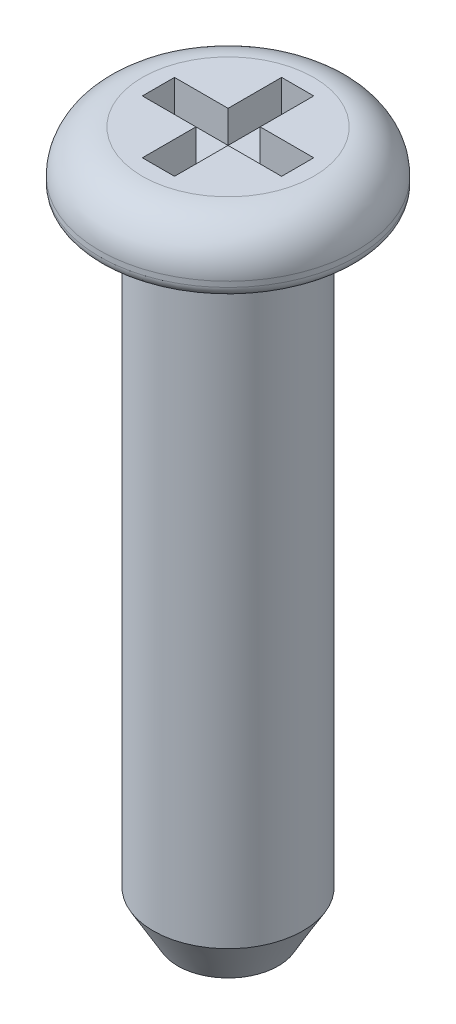
ISO-10303-21;
HEADER;
FILE_DESCRIPTION(('STEP AP214'),'2;1');
FILE_NAME('part.step','',(''),(''),'','','');
FILE_SCHEMA(('AUTOMOTIVE_DESIGN { 1 0 10303 214 1 1 1 1 }'));
ENDSEC;
DATA;
#1=APPLICATION_CONTEXT('core data for automotive mechanical design processes');
#2=APPLICATION_PROTOCOL_DEFINITION('international standard','automotive_design',2000,#1);
#3=PRODUCT_CONTEXT('',#1,'mechanical');
#4=PRODUCT('Part','Part','',(#3));
#5=PRODUCT_RELATED_PRODUCT_CATEGORY('part','',(#4));
#6=PRODUCT_DEFINITION_FORMATION('','',#4);
#7=PRODUCT_DEFINITION_CONTEXT('part definition',#1,'design');
#8=PRODUCT_DEFINITION('design','',#6,#7);
#9=PRODUCT_DEFINITION_SHAPE('','',#8);
#10=(LENGTH_UNIT() NAMED_UNIT(*) SI_UNIT(.MILLI.,.METRE.));
#11=(NAMED_UNIT(*) PLANE_ANGLE_UNIT() SI_UNIT($,.RADIAN.));
#12=(NAMED_UNIT(*) SI_UNIT($,.STERADIAN.) SOLID_ANGLE_UNIT());
#13=UNCERTAINTY_MEASURE_WITH_UNIT(LENGTH_MEASURE(1.E-05),#10,'distance_accuracy_value','');
#14=(GEOMETRIC_REPRESENTATION_CONTEXT(3) GLOBAL_UNCERTAINTY_ASSIGNED_CONTEXT((#13)) GLOBAL_UNIT_ASSIGNED_CONTEXT((#10,
#11,#12)) REPRESENTATION_CONTEXT('',''));
#15=CARTESIAN_POINT('',(0.,0.,0.));
#16=DIRECTION('',(0.,0.,1.));
#17=DIRECTION('',(1.,0.,0.));
#18=AXIS2_PLACEMENT_3D('',#15,#16,#17);
#19=CARTESIAN_POINT('',(0.,0.25,0.));
#20=DIRECTION('',(0.,1.,0.));
#21=DIRECTION('',(0.,0.,1.));
#22=AXIS2_PLACEMENT_3D('',#19,#20,#21);
#23=PLANE('',#22);
#24=DIRECTION('',(0.,0.,1.));
#25=VECTOR('',#24,1.);
#26=CARTESIAN_POINT('',(-0.65,0.25,-0.15));
#27=LINE('',#26,#25);
#28=CARTESIAN_POINT('',(-0.65,0.25,-0.15));
#29=VERTEX_POINT('',#28);
#30=CARTESIAN_POINT('',(-0.65,0.25,0.15));
#31=VERTEX_POINT('',#30);
#32=EDGE_CURVE('E121',#29,#31,#27,.T.);
#33=ORIENTED_EDGE('',*,*,#32,.T.);
#34=DIRECTION('',(1.,0.,0.));
#35=VECTOR('',#34,1.);
#36=CARTESIAN_POINT('',(-0.65,0.25,0.15));
#37=LINE('',#36,#35);
#38=CARTESIAN_POINT('',(-0.15,0.25,0.15));
#39=VERTEX_POINT('',#38);
#40=EDGE_CURVE('E213',#31,#39,#37,.T.);
#41=ORIENTED_EDGE('',*,*,#40,.T.);
#42=DIRECTION('',(0.,0.,1.));
#43=VECTOR('',#42,1.);
#44=CARTESIAN_POINT('',(-0.15,0.25,0.15));
#45=LINE('',#44,#43);
#46=CARTESIAN_POINT('',(-0.15,0.25,0.65));
#47=VERTEX_POINT('',#46);
#48=EDGE_CURVE('E218',#39,#47,#45,.T.);
#49=ORIENTED_EDGE('',*,*,#48,.T.);
#50=DIRECTION('',(1.,0.,0.));
#51=VECTOR('',#50,1.);
#52=CARTESIAN_POINT('',(-0.15,0.25,0.65));
#53=LINE('',#52,#51);
#54=CARTESIAN_POINT('',(0.15,0.25,0.65));
#55=VERTEX_POINT('',#54);
#56=EDGE_CURVE('E222',#47,#55,#53,.T.);
#57=ORIENTED_EDGE('',*,*,#56,.T.);
#58=DIRECTION('',(0.,0.,-1.));
#59=VECTOR('',#58,1.);
#60=CARTESIAN_POINT('',(0.15,0.25,0.65));
#61=LINE('',#60,#59);
#62=CARTESIAN_POINT('',(0.15,0.25,0.15));
#63=VERTEX_POINT('',#62);
#64=EDGE_CURVE('E226',#55,#63,#61,.T.);
#65=ORIENTED_EDGE('',*,*,#64,.T.);
#66=DIRECTION('',(1.,0.,0.));
#67=VECTOR('',#66,1.);
#68=CARTESIAN_POINT('',(0.15,0.25,0.15));
#69=LINE('',#68,#67);
#70=CARTESIAN_POINT('',(0.65,0.25,0.15));
#71=VERTEX_POINT('',#70);
#72=EDGE_CURVE('E230',#63,#71,#69,.T.);
#73=ORIENTED_EDGE('',*,*,#72,.T.);
#74=DIRECTION('',(0.,0.,-1.));
#75=VECTOR('',#74,1.);
#76=CARTESIAN_POINT('',(0.65,0.25,0.15));
#77=LINE('',#76,#75);
#78=CARTESIAN_POINT('',(0.65,0.25,-0.15));
#79=VERTEX_POINT('',#78);
#80=EDGE_CURVE('E234',#71,#79,#77,.T.);
#81=ORIENTED_EDGE('',*,*,#80,.T.);
#82=DIRECTION('',(-1.,0.,0.));
#83=VECTOR('',#82,1.);
#84=CARTESIAN_POINT('',(0.65,0.25,-0.15));
#85=LINE('',#84,#83);
#86=CARTESIAN_POINT('',(0.15,0.25,-0.15));
#87=VERTEX_POINT('',#86);
#88=EDGE_CURVE('E238',#79,#87,#85,.T.);
#89=ORIENTED_EDGE('',*,*,#88,.T.);
#90=DIRECTION('',(0.,0.,-1.));
#91=VECTOR('',#90,1.);
#92=CARTESIAN_POINT('',(0.15,0.25,-0.15));
#93=LINE('',#92,#91);
#94=CARTESIAN_POINT('',(0.15,0.25,-0.65));
#95=VERTEX_POINT('',#94);
#96=EDGE_CURVE('E242',#87,#95,#93,.T.);
#97=ORIENTED_EDGE('',*,*,#96,.T.);
#98=DIRECTION('',(-1.,0.,0.));
#99=VECTOR('',#98,1.);
#100=CARTESIAN_POINT('',(0.15,0.25,-0.65));
#101=LINE('',#100,#99);
#102=CARTESIAN_POINT('',(-0.15,0.25,-0.65));
#103=VERTEX_POINT('',#102);
#104=EDGE_CURVE('E246',#95,#103,#101,.T.);
#105=ORIENTED_EDGE('',*,*,#104,.T.);
#106=DIRECTION('',(0.,0.,1.));
#107=VECTOR('',#106,1.);
#108=CARTESIAN_POINT('',(-0.15,0.25,-0.65));
#109=LINE('',#108,#107);
#110=CARTESIAN_POINT('',(-0.15,0.25,-0.15));
#111=VERTEX_POINT('',#110);
#112=EDGE_CURVE('E117',#103,#111,#109,.T.);
#113=ORIENTED_EDGE('',*,*,#112,.T.);
#114=DIRECTION('',(-1.,0.,0.));
#115=VECTOR('',#114,1.);
#116=CARTESIAN_POINT('',(-0.15,0.25,-0.15));
#117=LINE('',#116,#115);
#118=EDGE_CURVE('E119',#111,#29,#117,.T.);
#119=ORIENTED_EDGE('',*,*,#118,.T.);
#120=EDGE_LOOP('',(#33,#41,#49,#57,#65,#73,#81,#89,#97,#105,#113,#119));
#121=FACE_BOUND('',#120,.T.);
#122=ADVANCED_FACE('F17',(#121),#23,.T.);
#123=CARTESIAN_POINT('',(-0.65,0.55,-0.15));
#124=DIRECTION('',(-1.,0.,0.));
#125=DIRECTION('',(0.,0.,1.));
#126=AXIS2_PLACEMENT_3D('',#123,#124,#125);
#127=PLANE('',#126);
#128=ORIENTED_EDGE('',*,*,#32,.F.);
#129=DIRECTION('',(0.,1.,0.));
#130=VECTOR('',#129,1.);
#131=CARTESIAN_POINT('',(-0.65,0.55,-0.15));
#132=LINE('',#131,#130);
#133=CARTESIAN_POINT('',(-0.65,0.55,-0.15));
#134=VERTEX_POINT('',#133);
#135=EDGE_CURVE('E126',#29,#134,#132,.T.);
#136=ORIENTED_EDGE('',*,*,#135,.T.);
#137=DIRECTION('',(0.,0.,1.));
#138=VECTOR('',#137,1.);
#139=CARTESIAN_POINT('',(-0.65,0.55,0.));
#140=LINE('',#139,#138);
#141=CARTESIAN_POINT('',(-0.65,0.55,0.15));
#142=VERTEX_POINT('',#141);
#143=EDGE_CURVE('E212',#142,#134,#140,.F.);
#144=ORIENTED_EDGE('',*,*,#143,.F.);
#145=DIRECTION('',(0.,1.,0.));
#146=VECTOR('',#145,1.);
#147=CARTESIAN_POINT('',(-0.65,0.55,0.15));
#148=LINE('',#147,#146);
#149=EDGE_CURVE('E132',#142,#31,#148,.F.);
#150=ORIENTED_EDGE('',*,*,#149,.T.);
#151=EDGE_LOOP('',(#128,#136,#144,#150));
#152=FACE_BOUND('',#151,.T.);
#153=ADVANCED_FACE('F129',(#152),#127,.F.);
#154=CARTESIAN_POINT('',(-0.15,0.55,-0.15));
#155=DIRECTION('',(0.,0.,-1.));
#156=DIRECTION('',(-1.,0.,0.));
#157=AXIS2_PLACEMENT_3D('',#154,#155,#156);
#158=PLANE('',#157);
#159=ORIENTED_EDGE('',*,*,#118,.F.);
#160=DIRECTION('',(0.,1.,0.));
#161=VECTOR('',#160,1.);
#162=CARTESIAN_POINT('',(-0.15,0.55,-0.15));
#163=LINE('',#162,#161);
#164=CARTESIAN_POINT('',(-0.15,0.55,-0.15));
#165=VERTEX_POINT('',#164);
#166=EDGE_CURVE('E140',#111,#165,#163,.T.);
#167=ORIENTED_EDGE('',*,*,#166,.T.);
#168=DIRECTION('',(1.,0.,0.));
#169=VECTOR('',#168,1.);
#170=CARTESIAN_POINT('',(0.,0.55,-0.15));
#171=LINE('',#170,#169);
#172=EDGE_CURVE('E137',#134,#165,#171,.T.);
#173=ORIENTED_EDGE('',*,*,#172,.F.);
#174=ORIENTED_EDGE('',*,*,#135,.F.);
#175=EDGE_LOOP('',(#159,#167,#173,#174));
#176=FACE_BOUND('',#175,.T.);
#177=ADVANCED_FACE('F135',(#176),#158,.F.);
#178=CARTESIAN_POINT('',(-0.15,0.55,-0.65));
#179=DIRECTION('',(-1.,0.,0.));
#180=DIRECTION('',(0.,0.,1.));
#181=AXIS2_PLACEMENT_3D('',#178,#179,#180);
#182=PLANE('',#181);
#183=ORIENTED_EDGE('',*,*,#112,.F.);
#184=DIRECTION('',(0.,1.,0.));
#185=VECTOR('',#184,1.);
#186=CARTESIAN_POINT('',(-0.15,0.55,-0.65));
#187=LINE('',#186,#185);
#188=CARTESIAN_POINT('',(-0.15,0.55,-0.65));
#189=VERTEX_POINT('',#188);
#190=EDGE_CURVE('E244',#103,#189,#187,.T.);
#191=ORIENTED_EDGE('',*,*,#190,.T.);
#192=DIRECTION('',(0.,0.,1.));
#193=VECTOR('',#192,1.);
#194=CARTESIAN_POINT('',(-0.15,0.55,0.));
#195=LINE('',#194,#193);
#196=EDGE_CURVE('E250',#165,#189,#195,.F.);
#197=ORIENTED_EDGE('',*,*,#196,.F.);
#198=ORIENTED_EDGE('',*,*,#166,.F.);
#199=EDGE_LOOP('',(#183,#191,#197,#198));
#200=FACE_BOUND('',#199,.T.);
#201=ADVANCED_FACE('F251',(#200),#182,.F.);
#202=CARTESIAN_POINT('',(0.15,0.55,-0.65));
#203=DIRECTION('',(0.,0.,-1.));
#204=DIRECTION('',(-1.,0.,0.));
#205=AXIS2_PLACEMENT_3D('',#202,#203,#204);
#206=PLANE('',#205);
#207=ORIENTED_EDGE('',*,*,#104,.F.);
#208=DIRECTION('',(0.,1.,0.));
#209=VECTOR('',#208,1.);
#210=CARTESIAN_POINT('',(0.15,0.55,-0.65));
#211=LINE('',#210,#209);
#212=CARTESIAN_POINT('',(0.15,0.55,-0.65));
#213=VERTEX_POINT('',#212);
#214=EDGE_CURVE('E240',#95,#213,#211,.T.);
#215=ORIENTED_EDGE('',*,*,#214,.T.);
#216=DIRECTION('',(1.,0.,0.));
#217=VECTOR('',#216,1.);
#218=CARTESIAN_POINT('',(0.,0.55,-0.65));
#219=LINE('',#218,#217);
#220=EDGE_CURVE('E256',#189,#213,#219,.T.);
#221=ORIENTED_EDGE('',*,*,#220,.F.);
#222=ORIENTED_EDGE('',*,*,#190,.F.);
#223=EDGE_LOOP('',(#207,#215,#221,#222));
#224=FACE_BOUND('',#223,.T.);
#225=ADVANCED_FACE('F466',(#224),#206,.F.);
#226=CARTESIAN_POINT('',(0.15,0.55,-0.15));
#227=DIRECTION('',(1.,0.,0.));
#228=DIRECTION('',(0.,0.,-1.));
#229=AXIS2_PLACEMENT_3D('',#226,#227,#228);
#230=PLANE('',#229);
#231=ORIENTED_EDGE('',*,*,#96,.F.);
#232=DIRECTION('',(0.,1.,0.));
#233=VECTOR('',#232,1.);
#234=CARTESIAN_POINT('',(0.15,0.55,-0.15));
#235=LINE('',#234,#233);
#236=CARTESIAN_POINT('',(0.15,0.55,-0.15));
#237=VERTEX_POINT('',#236);
#238=EDGE_CURVE('E236',#87,#237,#235,.T.);
#239=ORIENTED_EDGE('',*,*,#238,.T.);
#240=DIRECTION('',(0.,0.,1.));
#241=VECTOR('',#240,1.);
#242=CARTESIAN_POINT('',(0.15,0.55,0.));
#243=LINE('',#242,#241);
#244=EDGE_CURVE('E264',#213,#237,#243,.T.);
#245=ORIENTED_EDGE('',*,*,#244,.F.);
#246=ORIENTED_EDGE('',*,*,#214,.F.);
#247=EDGE_LOOP('',(#231,#239,#245,#246));
#248=FACE_BOUND('',#247,.T.);
#249=ADVANCED_FACE('F457',(#248),#230,.F.);
#250=CARTESIAN_POINT('',(0.65,0.55,-0.15));
#251=DIRECTION('',(0.,0.,-1.));
#252=DIRECTION('',(-1.,0.,0.));
#253=AXIS2_PLACEMENT_3D('',#250,#251,#252);
#254=PLANE('',#253);
#255=ORIENTED_EDGE('',*,*,#88,.F.);
#256=DIRECTION('',(0.,1.,0.));
#257=VECTOR('',#256,1.);
#258=CARTESIAN_POINT('',(0.65,0.55,-0.15));
#259=LINE('',#258,#257);
#260=CARTESIAN_POINT('',(0.65,0.55,-0.15));
#261=VERTEX_POINT('',#260);
#262=EDGE_CURVE('E232',#79,#261,#259,.T.);
#263=ORIENTED_EDGE('',*,*,#262,.T.);
#264=DIRECTION('',(1.,0.,0.));
#265=VECTOR('',#264,1.);
#266=CARTESIAN_POINT('',(0.,0.55,-0.15));
#267=LINE('',#266,#265);
#268=EDGE_CURVE('E267',#237,#261,#267,.T.);
#269=ORIENTED_EDGE('',*,*,#268,.F.);
#270=ORIENTED_EDGE('',*,*,#238,.F.);
#271=EDGE_LOOP('',(#255,#263,#269,#270));
#272=FACE_BOUND('',#271,.T.);
#273=ADVANCED_FACE('F448',(#272),#254,.F.);
#274=CARTESIAN_POINT('',(0.65,0.55,0.15));
#275=DIRECTION('',(1.,0.,0.));
#276=DIRECTION('',(0.,0.,-1.));
#277=AXIS2_PLACEMENT_3D('',#274,#275,#276);
#278=PLANE('',#277);
#279=ORIENTED_EDGE('',*,*,#80,.F.);
#280=DIRECTION('',(0.,1.,0.));
#281=VECTOR('',#280,1.);
#282=CARTESIAN_POINT('',(0.65,0.55,0.15));
#283=LINE('',#282,#281);
#284=CARTESIAN_POINT('',(0.65,0.55,0.15));
#285=VERTEX_POINT('',#284);
#286=EDGE_CURVE('E228',#71,#285,#283,.T.);
#287=ORIENTED_EDGE('',*,*,#286,.T.);
#288=DIRECTION('',(0.,0.,1.));
#289=VECTOR('',#288,1.);
#290=CARTESIAN_POINT('',(0.65,0.55,0.));
#291=LINE('',#290,#289);
#292=EDGE_CURVE('E270',#261,#285,#291,.T.);
#293=ORIENTED_EDGE('',*,*,#292,.F.);
#294=ORIENTED_EDGE('',*,*,#262,.F.);
#295=EDGE_LOOP('',(#279,#287,#293,#294));
#296=FACE_BOUND('',#295,.T.);
#297=ADVANCED_FACE('F439',(#296),#278,.F.);
#298=CARTESIAN_POINT('',(0.15,0.55,0.15));
#299=DIRECTION('',(0.,0.,1.));
#300=DIRECTION('',(1.,0.,0.));
#301=AXIS2_PLACEMENT_3D('',#298,#299,#300);
#302=PLANE('',#301);
#303=ORIENTED_EDGE('',*,*,#72,.F.);
#304=DIRECTION('',(0.,1.,0.));
#305=VECTOR('',#304,1.);
#306=CARTESIAN_POINT('',(0.15,0.55,0.15));
#307=LINE('',#306,#305);
#308=CARTESIAN_POINT('',(0.15,0.55,0.15));
#309=VERTEX_POINT('',#308);
#310=EDGE_CURVE('E224',#63,#309,#307,.T.);
#311=ORIENTED_EDGE('',*,*,#310,.T.);
#312=DIRECTION('',(1.,0.,0.));
#313=VECTOR('',#312,1.);
#314=CARTESIAN_POINT('',(0.,0.55,0.15));
#315=LINE('',#314,#313);
#316=EDGE_CURVE('E273',#285,#309,#315,.F.);
#317=ORIENTED_EDGE('',*,*,#316,.F.);
#318=ORIENTED_EDGE('',*,*,#286,.F.);
#319=EDGE_LOOP('',(#303,#311,#317,#318));
#320=FACE_BOUND('',#319,.T.);
#321=ADVANCED_FACE('F430',(#320),#302,.F.);
#322=CARTESIAN_POINT('',(0.15,0.55,0.65));
#323=DIRECTION('',(1.,0.,0.));
#324=DIRECTION('',(0.,0.,-1.));
#325=AXIS2_PLACEMENT_3D('',#322,#323,#324);
#326=PLANE('',#325);
#327=ORIENTED_EDGE('',*,*,#64,.F.);
#328=DIRECTION('',(0.,1.,0.));
#329=VECTOR('',#328,1.);
#330=CARTESIAN_POINT('',(0.15,0.55,0.65));
#331=LINE('',#330,#329);
#332=CARTESIAN_POINT('',(0.15,0.55,0.65));
#333=VERTEX_POINT('',#332);
#334=EDGE_CURVE('E220',#55,#333,#331,.T.);
#335=ORIENTED_EDGE('',*,*,#334,.T.);
#336=DIRECTION('',(0.,0.,1.));
#337=VECTOR('',#336,1.);
#338=CARTESIAN_POINT('',(0.15,0.55,0.));
#339=LINE('',#338,#337);
#340=EDGE_CURVE('E276',#309,#333,#339,.T.);
#341=ORIENTED_EDGE('',*,*,#340,.F.);
#342=ORIENTED_EDGE('',*,*,#310,.F.);
#343=EDGE_LOOP('',(#327,#335,#341,#342));
#344=FACE_BOUND('',#343,.T.);
#345=ADVANCED_FACE('F421',(#344),#326,.F.);
#346=CARTESIAN_POINT('',(-0.15,0.55,0.65));
#347=DIRECTION('',(0.,0.,1.));
#348=DIRECTION('',(1.,0.,0.));
#349=AXIS2_PLACEMENT_3D('',#346,#347,#348);
#350=PLANE('',#349);
#351=ORIENTED_EDGE('',*,*,#56,.F.);
#352=DIRECTION('',(0.,1.,0.));
#353=VECTOR('',#352,1.);
#354=CARTESIAN_POINT('',(-0.15,0.55,0.65));
#355=LINE('',#354,#353);
#356=CARTESIAN_POINT('',(-0.15,0.55,0.65));
#357=VERTEX_POINT('',#356);
#358=EDGE_CURVE('E216',#47,#357,#355,.T.);
#359=ORIENTED_EDGE('',*,*,#358,.T.);
#360=DIRECTION('',(1.,0.,0.));
#361=VECTOR('',#360,1.);
#362=CARTESIAN_POINT('',(0.,0.55,0.65));
#363=LINE('',#362,#361);
#364=EDGE_CURVE('E279',#333,#357,#363,.F.);
#365=ORIENTED_EDGE('',*,*,#364,.F.);
#366=ORIENTED_EDGE('',*,*,#334,.F.);
#367=EDGE_LOOP('',(#351,#359,#365,#366));
#368=FACE_BOUND('',#367,.T.);
#369=ADVANCED_FACE('F412',(#368),#350,.F.);
#370=CARTESIAN_POINT('',(-0.15,0.55,0.15));
#371=DIRECTION('',(-1.,0.,0.));
#372=DIRECTION('',(0.,0.,1.));
#373=AXIS2_PLACEMENT_3D('',#370,#371,#372);
#374=PLANE('',#373);
#375=ORIENTED_EDGE('',*,*,#48,.F.);
#376=DIRECTION('',(0.,1.,0.));
#377=VECTOR('',#376,1.);
#378=CARTESIAN_POINT('',(-0.15,0.55,0.15));
#379=LINE('',#378,#377);
#380=CARTESIAN_POINT('',(-0.15,0.55,0.15));
#381=VERTEX_POINT('',#380);
#382=EDGE_CURVE('E205',#39,#381,#379,.T.);
#383=ORIENTED_EDGE('',*,*,#382,.T.);
#384=DIRECTION('',(0.,0.,1.));
#385=VECTOR('',#384,1.);
#386=CARTESIAN_POINT('',(-0.15,0.55,0.));
#387=LINE('',#386,#385);
#388=EDGE_CURVE('E282',#357,#381,#387,.F.);
#389=ORIENTED_EDGE('',*,*,#388,.F.);
#390=ORIENTED_EDGE('',*,*,#358,.F.);
#391=EDGE_LOOP('',(#375,#383,#389,#390));
#392=FACE_BOUND('',#391,.T.);
#393=ADVANCED_FACE('F404',(#392),#374,.F.);
#394=CARTESIAN_POINT('',(-0.65,0.55,0.15));
#395=DIRECTION('',(0.,0.,1.));
#396=DIRECTION('',(1.,0.,0.));
#397=AXIS2_PLACEMENT_3D('',#394,#395,#396);
#398=PLANE('',#397);
#399=ORIENTED_EDGE('',*,*,#40,.F.);
#400=ORIENTED_EDGE('',*,*,#149,.F.);
#401=DIRECTION('',(1.,0.,0.));
#402=VECTOR('',#401,1.);
#403=CARTESIAN_POINT('',(0.,0.55,0.15));
#404=LINE('',#403,#402);
#405=EDGE_CURVE('E284',#381,#142,#404,.F.);
#406=ORIENTED_EDGE('',*,*,#405,.F.);
#407=ORIENTED_EDGE('',*,*,#382,.F.);
#408=EDGE_LOOP('',(#399,#400,#406,#407));
#409=FACE_BOUND('',#408,.T.);
#410=ADVANCED_FACE('F397',(#409),#398,.F.);
#411=CARTESIAN_POINT('',(0.,0.55,0.));
#412=DIRECTION('',(0.,1.,0.));
#413=DIRECTION('',(0.,0.,1.));
#414=AXIS2_PLACEMENT_3D('',#411,#412,#413);
#415=PLANE('',#414);
#416=ORIENTED_EDGE('',*,*,#388,.T.);
#417=ORIENTED_EDGE('',*,*,#405,.T.);
#418=ORIENTED_EDGE('',*,*,#143,.T.);
#419=ORIENTED_EDGE('',*,*,#172,.T.);
#420=ORIENTED_EDGE('',*,*,#196,.T.);
#421=ORIENTED_EDGE('',*,*,#220,.T.);
#422=ORIENTED_EDGE('',*,*,#244,.T.);
#423=ORIENTED_EDGE('',*,*,#268,.T.);
#424=ORIENTED_EDGE('',*,*,#292,.T.);
#425=ORIENTED_EDGE('',*,*,#316,.T.);
#426=ORIENTED_EDGE('',*,*,#340,.T.);
#427=ORIENTED_EDGE('',*,*,#364,.T.);
#428=EDGE_LOOP('',(#416,#417,#418,#419,#420,#421,#422,#423,#424,#425,#426,#427));
#429=FACE_BOUND('',#428,.T.);
#430=CARTESIAN_POINT('',(0.,0.55,0.));
#431=DIRECTION('',(0.,-1.,0.));
#432=DIRECTION('',(0.,0.,1.));
#433=AXIS2_PLACEMENT_3D('',#430,#431,#432);
#434=CIRCLE('',#433,0.79999999550235);
#435=CARTESIAN_POINT('',(0.,0.55,0.79999999280376));
#436=VERTEX_POINT('',#435);
#437=CARTESIAN_POINT('',(0.,0.55,-0.79999999280376));
#438=VERTEX_POINT('',#437);
#439=EDGE_CURVE('E304',#436,#438,#434,.T.);
#440=ORIENTED_EDGE('',*,*,#439,.F.);
#441=CARTESIAN_POINT('',(0.,0.55,0.));
#442=DIRECTION('',(0.,-1.,0.));
#443=DIRECTION('',(0.,0.,-1.));
#444=AXIS2_PLACEMENT_3D('',#441,#442,#443);
#445=CIRCLE('',#444,0.7999999910047);
#446=EDGE_CURVE('E286',#438,#436,#445,.T.);
#447=ORIENTED_EDGE('',*,*,#446,.F.);
#448=EDGE_LOOP('',(#440,#447));
#449=FACE_BOUND('',#448,.T.);
#450=ADVANCED_FACE('F193',(#429,#449),#415,.T.);
#451=CARTESIAN_POINT('',(0.,0.15,0.));
#452=DIRECTION('',(0.,1.,0.));
#453=DIRECTION('',(0.00945357762261842,0.,-0.999955313936644));
#454=AXIS2_PLACEMENT_3D('',#451,#452,#453);
#455=TOROIDAL_SURFACE('',#454,0.8,0.4);
#456=CARTESIAN_POINT('',(0.,0.15,0.));
#457=DIRECTION('',(0.,1.,0.));
#458=DIRECTION('',(0.,0.,1.));
#459=AXIS2_PLACEMENT_3D('',#456,#457,#458);
#460=CIRCLE('',#459,1.2);
#461=CARTESIAN_POINT('',(0.,0.15,1.2));
#462=VERTEX_POINT('',#461);
#463=EDGE_CURVE('E184',#462,#462,#460,.F.);
#464=ORIENTED_EDGE('',*,*,#463,.F.);
#465=EDGE_LOOP('',(#464));
#466=FACE_BOUND('',#465,.T.);
#467=ORIENTED_EDGE('',*,*,#439,.T.);
#468=ORIENTED_EDGE('',*,*,#446,.T.);
#469=EDGE_LOOP('',(#467,#468));
#470=FACE_BOUND('',#469,.T.);
#471=ADVANCED_FACE('F188',(#466,#470),#455,.T.);
#472=CARTESIAN_POINT('',(0.,0.,0.));
#473=DIRECTION('',(0.,1.,0.));
#474=DIRECTION('',(0.,0.,1.));
#475=AXIS2_PLACEMENT_3D('',#472,#473,#474);
#476=CYLINDRICAL_SURFACE('',#475,1.2);
#477=CARTESIAN_POINT('',(0.,0.1,0.));
#478=DIRECTION('',(0.,1.,0.));
#479=DIRECTION('',(0.0134291293986406,0.,0.999909825176048));
#480=AXIS2_PLACEMENT_3D('',#477,#478,#479);
#481=CIRCLE('',#480,1.2);
#482=CARTESIAN_POINT('',(0.0161149552783688,0.1,1.19989179021126));
#483=VERTEX_POINT('',#482);
#484=EDGE_CURVE('E146',#483,#483,#481,.F.);
#485=ORIENTED_EDGE('',*,*,#484,.F.);
#486=EDGE_LOOP('',(#485));
#487=FACE_BOUND('',#486,.T.);
#488=ORIENTED_EDGE('',*,*,#463,.T.);
#489=EDGE_LOOP('',(#488));
#490=FACE_BOUND('',#489,.T.);
#491=ADVANCED_FACE('F192',(#487,#490),#476,.T.);
#492=CARTESIAN_POINT('',(0.,-6.,0.));
#493=DIRECTION('',(0.,-1.,0.));
#494=DIRECTION('',(0.,0.,-1.));
#495=AXIS2_PLACEMENT_3D('',#492,#493,#494);
#496=PLANE('',#495);
#497=CARTESIAN_POINT('',(0.,-5.99999999997181,0.));
#498=DIRECTION('',(0.,1.,0.));
#499=DIRECTION('',(0.,0.,1.));
#500=AXIS2_PLACEMENT_3D('',#497,#498,#499);
#501=CIRCLE('',#500,0.469059892282075);
#502=CARTESIAN_POINT('',(0.,-5.99999999997181,0.469059892282075));
#503=VERTEX_POINT('',#502);
#504=EDGE_CURVE('E144',#503,#503,#501,.T.);
#505=ORIENTED_EDGE('',*,*,#504,.F.);
#506=EDGE_LOOP('',(#505));
#507=FACE_BOUND('',#506,.T.);
#508=ADVANCED_FACE('F163',(#507),#496,.T.);
#509=CARTESIAN_POINT('',(0.,0.1,0.));
#510=DIRECTION('',(0.,1.,0.));
#511=DIRECTION('',(0.0134291293986406,0.,0.999909825176048));
#512=AXIS2_PLACEMENT_3D('',#509,#510,#511);
#513=TOROIDAL_SURFACE('',#512,1.1,0.1);
#514=ORIENTED_EDGE('',*,*,#484,.T.);
#515=EDGE_LOOP('',(#514));
#516=FACE_BOUND('',#515,.T.);
#517=CARTESIAN_POINT('',(0.,0.,0.));
#518=DIRECTION('',(0.,1.,0.));
#519=DIRECTION('',(0.,0.,-1.));
#520=AXIS2_PLACEMENT_3D('',#517,#518,#519);
#521=CIRCLE('',#520,1.0999999820745);
#522=CARTESIAN_POINT('',(0.,0.,-1.0999999749043));
#523=VERTEX_POINT('',#522);
#524=CARTESIAN_POINT('',(0.,0.,1.0999999749043));
#525=VERTEX_POINT('',#524);
#526=EDGE_CURVE('E173',#523,#525,#521,.T.);
#527=ORIENTED_EDGE('',*,*,#526,.T.);
#528=CARTESIAN_POINT('',(0.,0.,1.099999964149));
#529=CARTESIAN_POINT('',(0.00492406061414348,-3.54563877889075E-11,1.10000049536148));
#530=CARTESIAN_POINT('',(0.00984825022011473,-2.07130719296641E-11,1.09996849488545));
#531=CARTESIAN_POINT('',(0.0266316200309335,2.00630534293323E-10,1.09974791268392));
#532=CARTESIAN_POINT('',(0.0384890835170656,6.48227424068439E-10,1.09940226453741));
#533=CARTESIAN_POINT('',(0.0621864091491095,2.12545776433485E-09,1.09832633674333));
#534=CARTESIAN_POINT('',(0.0740262710790623,3.15509829796221E-09,1.09759605241496));
#535=CARTESIAN_POINT('',(0.100209082047479,5.97279352624228E-09,1.09555562836706));
#536=CARTESIAN_POINT('',(0.114545063485567,7.876046159774E-09,1.09415480101715));
#537=CARTESIAN_POINT('',(0.143150944482853,1.22775011359457E-08,1.09079092629783));
#538=CARTESIAN_POINT('',(0.15742084315618,1.47757114308651E-08,1.08882787141354));
#539=CARTESIAN_POINT('',(0.185872733977188,2.02436595798314E-08,1.0843426909109));
#540=CARTESIAN_POINT('',(0.200054725015496,2.32134033719787E-08,1.08182055825184));
#541=CARTESIAN_POINT('',(0.228308833397649,2.95107238903449E-08,1.07622106855444));
#542=CARTESIAN_POINT('',(0.242380949440641,3.2838304846266E-08,1.07314370495287));
#543=CARTESIAN_POINT('',(0.270393584454543,3.97441645805892E-08,1.0664385031888));
#544=CARTESIAN_POINT('',(0.284334101969741,4.33224461285036E-08,1.06281065894455));
#545=CARTESIAN_POINT('',(0.312061999565104,5.06299803370416E-08,1.05501008495274));
#546=CARTESIAN_POINT('',(0.325849378070124,5.43592345486978E-08,1.0508373496062));
#547=CARTESIAN_POINT('',(0.353249698936276,6.18761683401936E-08,1.04195342832046));
#548=CARTESIAN_POINT('',(0.36686263963839,6.56638484749481E-08,1.0372422372644));
#549=CARTESIAN_POINT('',(0.393893054035974,7.32123303041568E-08,1.02728867129659));
#550=CARTESIAN_POINT('',(0.407310526023777,7.69731317636458E-08,1.02204629174741));
#551=CARTESIAN_POINT('',(0.433929274348065,8.438977802763E-08,1.01103843722045));
#552=CARTESIAN_POINT('',(0.447130548963114,8.80456219965926E-08,1.00527295807997));
#553=CARTESIAN_POINT('',(0.473296507716812,9.51815051022812E-08,0.993227801690416));
#554=CARTESIAN_POINT('',(0.486261190154656,9.86615429754971E-08,0.986948120746649));
#555=CARTESIAN_POINT('',(0.511933935250397,1.05382194526751E-07,0.973884253284614));
#556=CARTESIAN_POINT('',(0.524641996261952,1.08622806669121E-07,0.967100063531004));
#557=CARTESIAN_POINT('',(0.549781865693902,1.14808216596856E-07,0.953037651186801));
#558=CARTESIAN_POINT('',(0.562213672555577,1.17753012713458E-07,0.945759425809634));
#559=CARTESIAN_POINT('',(0.586781827770156,1.23297629513838E-07,0.930720178966331));
#560=CARTESIAN_POINT('',(0.598918174684351,1.25897448518065E-07,0.922959155149919));
#561=CARTESIAN_POINT('',(0.622876660708366,1.30710179169617E-07,0.906966294802693));
#562=CARTESIAN_POINT('',(0.634698798531008,1.32923089232154E-07,0.898734456343593));
#563=CARTESIAN_POINT('',(0.658010602722806,1.36927299234906E-07,0.88181267817315));
#564=CARTESIAN_POINT('',(0.669500267986875,1.38718597773891E-07,0.873122736939416));
#565=CARTESIAN_POINT('',(0.692129377330427,1.41852111102811E-07,0.855298173101806));
#566=CARTESIAN_POINT('',(0.703268820516421,1.43194324747121E-07,0.846163549363604));
#567=CARTESIAN_POINT('',(0.725180277366503,1.45409423863692E-07,0.827463728053893));
#568=CARTESIAN_POINT('',(0.735952290377065,1.46282308501228E-07,0.817898529716617));
#569=CARTESIAN_POINT('',(0.757112246569873,1.4754573438082E-07,0.798352332569582));
#570=CARTESIAN_POINT('',(0.767500189365698,1.47936275137591E-07,0.788371333341498));
#571=CARTESIAN_POINT('',(0.787875958610776,1.48229227229716E-07,0.768008950735279));
#572=CARTESIAN_POINT('',(0.797863784966542,1.48131638451018E-07,0.757627567263595));
#573=CARTESIAN_POINT('',(0.817423893438803,1.47449774675404E-07,0.73648045159563));
#574=CARTESIAN_POINT('',(0.826996175779188,1.46865499940712E-07,0.725714719606437));
#575=CARTESIAN_POINT('',(0.845710410832574,1.45218936715657E-07,0.703815536614136));
#576=CARTESIAN_POINT('',(0.854852364109825,1.44156648852087E-07,0.692682086093216));
#577=CARTESIAN_POINT('',(0.872691821037045,1.41569961066279E-07,0.670064664294874));
#578=CARTESIAN_POINT('',(0.88138932561307,1.40045562106944E-07,0.658580693747878));
#579=CARTESIAN_POINT('',(0.898326452378921,1.36557783149615E-07,0.63527997208221));
#580=CARTESIAN_POINT('',(0.906566075876453,1.34594404405425E-07,0.623463221914102));
#581=CARTESIAN_POINT('',(0.922574715755324,1.30259026155237E-07,0.599515195659645));
#582=CARTESIAN_POINT('',(0.930343733844201,1.27887028131986E-07,0.587383920714742));
#583=CARTESIAN_POINT('',(0.945399165895756,1.2277200094422E-07,0.562825585772909));
#584=CARTESIAN_POINT('',(0.952685581982258,1.20028973412685E-07,0.550398527077986));
#585=CARTESIAN_POINT('',(0.966764559302153,1.14216706154493E-07,0.525267822706477));
#586=CARTESIAN_POINT('',(0.973557123090332,1.11147468115584E-07,0.51256417846116));
#587=CARTESIAN_POINT('',(0.986637908778086,1.04734828146223E-07,0.48689992854548));
#588=CARTESIAN_POINT('',(0.992926133676256,1.01391427846069E-07,0.473939324403469));
#589=CARTESIAN_POINT('',(1.00498853445922,9.44897410335962E-08,0.447781177361619));
#590=CARTESIAN_POINT('',(1.01076271379739,9.09314559651501E-08,0.434583636054248));
#591=CARTESIAN_POINT('',(1.02178811127848,8.36665066936245E-08,0.407972003452976));
#592=CARTESIAN_POINT('',(1.0270393333386,7.9959843602261E-08,0.394557913782003));
#593=CARTESIAN_POINT('',(1.03701071274552,7.24718747804463E-08,0.367533907815091));
#594=CARTESIAN_POINT('',(1.04173087448046,6.86905696670644E-08,0.353923993138299));
#595=CARTESIAN_POINT('',(1.0506328511473,6.11342826864161E-08,0.326529362857625));
#596=CARTESIAN_POINT('',(1.0548146709434,5.73593007623208E-08,0.31274464883438));
#597=CARTESIAN_POINT('',(1.06263351345602,4.99038556563341E-08,0.285021716002346));
#598=CARTESIAN_POINT('',(1.06627054151591,4.62233915476984E-08,0.271083498700568));
#599=CARTESIAN_POINT('',(1.07299419531971,3.90524064507453E-08,0.243075090490871));
#600=CARTESIAN_POINT('',(1.0760808268872,3.55618834529927E-08,0.229004900980966));
#601=CARTESIAN_POINT('',(1.08169892401068,2.88734366598055E-08,0.200754290352376));
#602=CARTESIAN_POINT('',(1.08423039586959,2.56755095426699E-08,0.186573870487068));
#603=CARTESIAN_POINT('',(1.08873430415371,1.96821318116862E-08,0.158124684314645));
#604=CARTESIAN_POINT('',(1.09070674735773,1.68866763176464E-08,0.143855919080956));
#605=CARTESIAN_POINT('',(1.0940894598077,1.18153794350461E-08,0.115252163496765));
#606=CARTESIAN_POINT('',(1.09549973630494,9.53953134431902E-09,0.10091717400289));
#607=CARTESIAN_POINT('',(1.09785584023407,5.45940235223333E-09,0.0709367805184028));
#608=CARTESIAN_POINT('',(1.09874975566628,3.71438954108244E-09,0.0552872735278813));
#609=CARTESIAN_POINT('',(1.09986648657077,1.15664651883511E-09,0.023964484014948));
#610=CARTESIAN_POINT('',(1.10008931264139,3.43901584822091E-10,0.00829120187192166));
#611=CARTESIAN_POINT('',(1.09989117475396,-1.18413752386299E-10,-0.0199659165565262));
#612=CARTESIAN_POINT('',(1.09958827677527,3.45836192334752E-11,-0.0325507357265375));
#613=CARTESIAN_POINT('',(1.09855834620432,-3.02449267852054E-11,-0.0577023987569379));
#614=CARTESIAN_POINT('',(1.09783133648764,-2.48050845405789E-10,-0.0702692435501762));
#615=CARTESIAN_POINT('',(1.09586216431043,2.43293613789714E-09,-0.0965847114183525));
#616=CARTESIAN_POINT('',(1.09457699381668,5.63506451298166E-09,-0.110330131428817));
#617=CARTESIAN_POINT('',(1.09149749189644,2.31557186651534E-08,-0.137763674133374));
#618=CARTESIAN_POINT('',(1.08970316913178,3.74740553376219E-08,-0.151451797798188));
#619=CARTESIAN_POINT('',(1.08616858193514,9.06639031624185E-08,-0.175034819177205));
#620=CARTESIAN_POINT('',(1.08454665762458,1.21787357111796E-07,-0.184947611442554));
#621=CARTESIAN_POINT('',(1.08124911392734,1.89925136931563E-07,-0.203490360990856));
#622=CARTESIAN_POINT('',(1.07960547014989,2.25719147849564E-07,-0.212125990348747));
#623=CARTESIAN_POINT('',(1.07610260808944,2.8080833008651E-07,-0.229352690115622));
#624=CARTESIAN_POINT('',(1.07424340475752,3.00104644898698E-07,-0.237943763571846));
#625=CARTESIAN_POINT('',(1.06918911525695,3.25060334428146E-07,-0.259975015703475));
#626=CARTESIAN_POINT('',(1.06583793650072,3.16618093988028E-07,-0.273379715498288));
#627=CARTESIAN_POINT('',(1.05861253506053,2.55491358623188E-07,-0.3000444531089));
#628=CARTESIAN_POINT('',(1.05473841275256,2.02815344007594E-07,-0.313304518159878));
#629=CARTESIAN_POINT('',(1.04797343327704,1.12003665093369E-07,-0.33491244807513));
#630=CARTESIAN_POINT('',(1.04523183434835,7.54751448264891E-08,-0.343307254541216));
#631=CARTESIAN_POINT('',(1.03952210597188,2.11425820731445E-08,-0.36001773571178));
#632=CARTESIAN_POINT('',(1.03655401638492,3.33525289841848E-09,-0.368333424052109));
#633=CARTESIAN_POINT('',(1.03235310897247,-1.26730185417908E-09,-0.379800778235677));
#634=CARTESIAN_POINT('',(1.03117901743768,-4.15452884065827E-10,-0.382974356847692));
#635=CARTESIAN_POINT('',(1.02607614710643,1.94385662197352E-09,-0.396588744189392));
#636=CARTESIAN_POINT('',(1.02201389245796,4.6360210817231E-10,-0.406979887937021));
#637=CARTESIAN_POINT('',(1.01073395402737,6.31294862615277E-09,-0.434587572934738));
#638=CARTESIAN_POINT('',(1.0032330321862,2.02441472907203E-08,-0.451689754143541));
#639=CARTESIAN_POINT('',(0.991816670089626,5.5205528222469E-08,-0.476024529886065));
#640=CARTESIAN_POINT('',(0.988245611344828,6.78916344004985E-08,-0.483420921987698));
#641=CARTESIAN_POINT('',(0.980538756399855,1.00498821013041E-07,-0.498938961311803));
#642=CARTESIAN_POINT('',(0.976383969835955,1.21060645340049E-07,-0.507051213975982));
#643=CARTESIAN_POINT('',(0.967398593906242,1.67068268698821E-07,-0.524066744764665));
#644=CARTESIAN_POINT('',(0.962544273310497,1.92802961943922E-07,-0.532957501041786));
#645=CARTESIAN_POINT('',(0.952679660444967,2.35844305981708E-07,-0.550435050606951));
#646=CARTESIAN_POINT('',(0.947673930575112,2.53298413602338E-07,-0.559024423173791));
#647=CARTESIAN_POINT('',(0.934504024434889,2.85661062093756E-07,-0.58092362388186));
#648=CARTESIAN_POINT('',(0.926167440969935,2.93434186491511E-07,-0.594130348827811));
#649=CARTESIAN_POINT('',(0.909196565659136,2.71552017558968E-07,-0.619760561609387));
#650=CARTESIAN_POINT('',(0.900579723983974,2.43059023503897E-07,-0.632195628123829));
#651=CARTESIAN_POINT('',(0.882248017660091,1.82106204748537E-07,-0.657510117980308));
#652=CARTESIAN_POINT('',(0.872498233610048,1.49508614931118E-07,-0.670364273087031));
#653=CARTESIAN_POINT('',(0.852829461924519,1.03476862575812E-07,-0.695155577874854));
#654=CARTESIAN_POINT('',(0.842930978349541,8.93616407271871E-08,-0.707109012649114));
#655=CARTESIAN_POINT('',(0.822508066213524,6.77446333383957E-08,-0.730742125203956));
#656=CARTESIAN_POINT('',(0.811977167626712,6.0331313754422E-08,-0.742416215149923));
#657=CARTESIAN_POINT('',(0.790896887057742,5.20290833596885E-08,-0.764809071566651));
#658=CARTESIAN_POINT('',(0.780368174557243,5.08707766748338E-08,-0.775547308242081));
#659=CARTESIAN_POINT('',(0.759371077868827,5.43451973128639E-08,-0.796109845728025));
#660=CARTESIAN_POINT('',(0.748921648909714,5.87174450284905E-08,-0.805953506495207));
#661=CARTESIAN_POINT('',(0.728154941776352,7.43069139101209E-08,-0.824770321175802));
#662=CARTESIAN_POINT('',(0.717854995203721,8.51888620665652E-08,-0.833762611970726));
#663=CARTESIAN_POINT('',(0.698106339817237,1.21655421099227E-07,-0.850375638386866));
#664=CARTESIAN_POINT('',(0.68869183359544,1.45452849293554E-07,-0.85803703913941));
#665=CARTESIAN_POINT('',(0.673316045865275,1.90661358177029E-07,-0.870132625283385));
#666=CARTESIAN_POINT('',(0.667432246399077,2.09415632210069E-07,-0.874665567057277));
#667=CARTESIAN_POINT('',(0.655452982780319,2.40454557689381E-07,-0.883697696539455));
#668=CARTESIAN_POINT('',(0.649355639397892,2.52602150068867E-07,-0.888194391075248));
#669=CARTESIAN_POINT('',(0.63137368694193,2.78930143530698E-07,-0.901166044475482));
#670=CARTESIAN_POINT('',(0.619362226169596,2.84562421193168E-07,-0.909466041899047));
#671=CARTESIAN_POINT('',(0.594577902475918,2.70667093138929E-07,-0.925860475490913));
#672=CARTESIAN_POINT('',(0.581793169011475,2.50233300245387E-07,-0.933936969837439));
#673=CARTESIAN_POINT('',(0.560865619975483,2.05141251577714E-07,-0.946553036607197));
#674=CARTESIAN_POINT('',(0.552823704027086,1.85111386111595E-07,-0.951260780874582));
#675=CARTESIAN_POINT('',(0.536457775998163,1.41164646710152E-07,-0.960559182219227));
#676=CARTESIAN_POINT('',(0.528131343171823,1.1717770838914E-07,-0.965145581106129));
#677=CARTESIAN_POINT('',(0.507814668744606,6.80219984831848E-08,-0.975995829111276));
#678=CARTESIAN_POINT('',(0.495764843787828,4.66473474887133E-08,-0.982148360485636));
#679=CARTESIAN_POINT('',(0.469459378874754,1.6420892972017E-08,-0.994982470192852));
#680=CARTESIAN_POINT('',(0.455165522574443,1.01915127598183E-08,-1.00158580712906));
#681=CARTESIAN_POINT('',(0.427489829963984,3.61448754998003E-09,-1.01366809030795));
#682=CARTESIAN_POINT('',(0.414128844240857,2.82804687292785E-09,-1.01919482120623));
#683=CARTESIAN_POINT('',(0.391556391385148,3.22578742960417E-09,-1.02802507711097));
#684=CARTESIAN_POINT('',(0.382399847295895,3.85508928900906E-09,-1.03146971467874));
#685=CARTESIAN_POINT('',(0.364650202856845,9.13599161415164E-09,-1.03788621238841));
#686=CARTESIAN_POINT('',(0.356062971486207,1.35004326975017E-08,-1.0408742811421));
#687=CARTESIAN_POINT('',(0.340452127831097,2.74080106524824E-08,-1.0460930681062));
#688=CARTESIAN_POINT('',(0.333440578551422,3.58130597494532E-08,-1.0483600021269));
#689=CARTESIAN_POINT('',(0.313225043576477,6.08461019431441E-08,-1.0546691194712));
#690=CARTESIAN_POINT('',(0.299964373104889,7.82410124243942E-08,-1.05853137636524));
#691=CARTESIAN_POINT('',(0.273305988760478,1.1012910013103E-07,-1.06574943124676));
#692=CARTESIAN_POINT('',(0.259908271721862,1.24622210164605E-07,-1.06910521750635));
#693=CARTESIAN_POINT('',(0.232994661898629,1.46004246497817E-07,-1.07530483420191));
#694=CARTESIAN_POINT('',(0.21947876804063,1.52893103656678E-07,-1.07814865998274));
#695=CARTESIAN_POINT('',(0.192348727556512,1.57369966077181E-07,-1.08332035310498));
#696=CARTESIAN_POINT('',(0.178734581418747,1.54958017535821E-07,-1.08564822300908));
#697=CARTESIAN_POINT('',(0.151427869726542,1.41414490308282E-07,-1.08978456966879));
#698=CARTESIAN_POINT('',(0.137735305669033,1.30283077521987E-07,-1.09159305630549));
#699=CARTESIAN_POINT('',(0.110291771203377,1.02410253889501E-07,-1.09468804164449));
#700=CARTESIAN_POINT('',(0.0965408027425983,8.56690286628705E-08,-1.09597455761482));
#701=CARTESIAN_POINT('',(0.0690005392474788,5.19410869140366E-08,-1.09802371575052));
#702=CARTESIAN_POINT('',(0.0552112460506125,3.4954382002759E-08,-1.09878638261112));
#703=CARTESIAN_POINT('',(0.0276144805563849,9.19906880967165E-09,-1.09978694107734));
#704=CARTESIAN_POINT('',(0.0138070094233613,4.29957590295563E-10,-1.10002486479978));
#705=CARTESIAN_POINT('',(0.,0.,-1.099999964149));
#706=B_SPLINE_CURVE_WITH_KNOTS('',3,(#528,#529,#530,#531,#532,#533,#534,#535,#536,#537,#538,
#539,#540,#541,#542,#543,#544,#545,#546,#547,#548,#549,#550,#551,#552,#553,#554,#555,#556,#557,
#558,#559,#560,#561,#562,#563,#564,#565,#566,#567,#568,#569,#570,#571,#572,#573,#574,#575,#576,
#577,#578,#579,#580,#581,#582,#583,#584,#585,#586,#587,#588,#589,#590,#591,#592,#593,#594,#595,
#596,#597,#598,#599,#600,#601,#602,#603,#604,#605,#606,#607,#608,#609,#610,#611,#612,#613,#614,
#615,#616,#617,#618,#619,#620,#621,#622,#623,#624,#625,#626,#627,#628,#629,#630,#631,#632,#633,
#634,#635,#636,#637,#638,#639,#640,#641,#642,#643,#644,#645,#646,#647,#648,#649,#650,#651,#652,
#653,#654,#655,#656,#657,#658,#659,#660,#661,#662,#663,#664,#665,#666,#667,#668,#669,#670,#671,
#672,#673,#674,#675,#676,#677,#678,#679,#680,#681,#682,#683,#684,#685,#686,#687,#688,#689,#690,
#691,#692,#693,#694,#695,#696,#697,#698,#699,#700,#701,#702,#703,#704,#705),.UNSPECIFIED.,.F.,
.F.,(4,2,2,2,2,2,2,2,2,2,2,2,2,2,2,2,2,2,2,2,2,2,2,2,2,2,2,2,2,2,2,2,2,2,2,2,2,2,2,2,2,2,2,2,2,
2,2,2,2,2,2,2,2,2,2,2,2,2,2,2,2,2,2,2,2,2,2,2,2,2,2,2,2,2,2,2,2,2,2,2,2,2,2,2,2,2,2,2,4),(0.,
0.0147723954018829,0.0503531745522048,0.0859343867094465,0.129135661865216,0.172337514487114,
0.215539911200346,0.25874281863012,0.301946203401638,0.345150032140106,0.388354271470734,
0.431558888018737,0.474763848409341,0.51796911926777,0.561174667219265,0.604380458889067,
0.647586460902435,0.690792639884625,0.733998962460903,0.777205395256542,0.820411904896815,
0.863618458007006,0.906825021212389,0.950031561138244,0.993238044409856,1.0364444376525,
1.07965070749144,1.12285682055196,1.1660627434593,1.20926844283874,1.25247388531551,
1.29567903751486,1.33888386606201,1.3820883375822,1.42529241870062,1.46849607604251,
1.51169927623304,1.55490198589744,1.59810417166089,1.6413058001486,1.68831640161216,
1.73532626064674,1.77308473083759,1.81084116461609,1.85224773337705,1.89365359776097,
1.92378392606563,1.95015313998766,1.97652052605064,2.0179610770966,2.05939368515153,
2.08588426746051,2.11237019831156,2.1225215974779,2.15598802324435,2.2119839047633,
2.23662253323591,2.26396254151121,2.2943474021167,2.32416873734703,2.3710063011939,
2.41637987146596,2.46476428432793,2.51131032149285,2.55846216267947,2.60356601061611,
2.64662250781531,2.68763220904436,2.72403929947964,2.746320100449,2.76904702631757,
2.8128348881196,2.85818734879531,2.88614015596291,2.91465506655399,2.95523488316866,
3.00245687135028,3.04582239254789,3.07516848248267,3.10244239274072,3.12454790996813,
3.16597201020838,3.20739706952165,3.2488225054843,3.29024773568754,3.33167217773753,
3.3730952492555,3.41451636787797,3.45593495125737),.UNSPECIFIED.);
#707=EDGE_CURVE('E36',#525,#523,#706,.T.);
#708=ORIENTED_EDGE('',*,*,#707,.T.);
#709=EDGE_LOOP('',(#527,#708));
#710=FACE_BOUND('',#709,.T.);
#711=ADVANCED_FACE('F151',(#516,#710),#513,.T.);
#712=CARTESIAN_POINT('',(0.,-5.60000000012906,0.));
#713=DIRECTION('',(0.,1.,0.));
#714=DIRECTION('',(0.,0.,1.));
#715=AXIS2_PLACEMENT_3D('',#712,#713,#714);
#716=CONICAL_SURFACE('',#715,0.699999999881129,0.523598775624535);
#717=CARTESIAN_POINT('',(0.,-5.6,0.));
#718=DIRECTION('',(0.,-1.,0.));
#719=DIRECTION('',(0.,0.,-1.));
#720=AXIS2_PLACEMENT_3D('',#717,#718,#719);
#721=CIRCLE('',#720,0.7);
#722=CARTESIAN_POINT('',(0.,-5.6,-0.7));
#723=VERTEX_POINT('',#722);
#724=EDGE_CURVE('E28',#723,#723,#721,.F.);
#725=ORIENTED_EDGE('',*,*,#724,.F.);
#726=EDGE_LOOP('',(#725));
#727=FACE_BOUND('',#726,.T.);
#728=ORIENTED_EDGE('',*,*,#504,.T.);
#729=EDGE_LOOP('',(#728));
#730=FACE_BOUND('',#729,.T.);
#731=ADVANCED_FACE('F162',(#727,#730),#716,.T.);
#732=CARTESIAN_POINT('',(0.,0.,0.));
#733=DIRECTION('',(0.,1.,0.));
#734=DIRECTION('',(0.,0.,1.));
#735=AXIS2_PLACEMENT_3D('',#732,#733,#734);
#736=PLANE('',#735);
#737=CARTESIAN_POINT('',(0.,0.,0.));
#738=DIRECTION('',(0.,-1.,0.));
#739=DIRECTION('',(0.,0.,-1.));
#740=AXIS2_PLACEMENT_3D('',#737,#738,#739);
#741=CIRCLE('',#740,0.7);
#742=CARTESIAN_POINT('',(0.,0.,-0.7));
#743=VERTEX_POINT('',#742);
#744=EDGE_CURVE('E11',#743,#743,#741,.T.);
#745=ORIENTED_EDGE('',*,*,#744,.F.);
#746=EDGE_LOOP('',(#745));
#747=FACE_BOUND('',#746,.T.);
#748=ORIENTED_EDGE('',*,*,#707,.F.);
#749=ORIENTED_EDGE('',*,*,#526,.F.);
#750=EDGE_LOOP('',(#748,#749));
#751=FACE_BOUND('',#750,.T.);
#752=ADVANCED_FACE('F319',(#747,#751),#736,.F.);
#753=CARTESIAN_POINT('',(0.,0.,0.));
#754=DIRECTION('',(0.,-1.,0.));
#755=DIRECTION('',(0.,0.,-1.));
#756=AXIS2_PLACEMENT_3D('',#753,#754,#755);
#757=CYLINDRICAL_SURFACE('',#756,0.7);
#758=ORIENTED_EDGE('',*,*,#724,.T.);
#759=EDGE_LOOP('',(#758));
#760=FACE_BOUND('',#759,.T.);
#761=ORIENTED_EDGE('',*,*,#744,.T.);
#762=EDGE_LOOP('',(#761));
#763=FACE_BOUND('',#762,.T.);
#764=ADVANCED_FACE('F317',(#760,#763),#757,.T.);
#765=CLOSED_SHELL('',(#122,#153,#177,#201,#225,#249,#273,#297,#321,#345,#369,#393,#410,#450,
#471,#491,#508,#711,#731,#752,#764));
#766=MANIFOLD_SOLID_BREP('B1',#765);
#767=ADVANCED_BREP_SHAPE_REPRESENTATION('',(#18,#766),#14);
#768=SHAPE_DEFINITION_REPRESENTATION(#9,#767);
ENDSEC;
END-ISO-10303-21;
